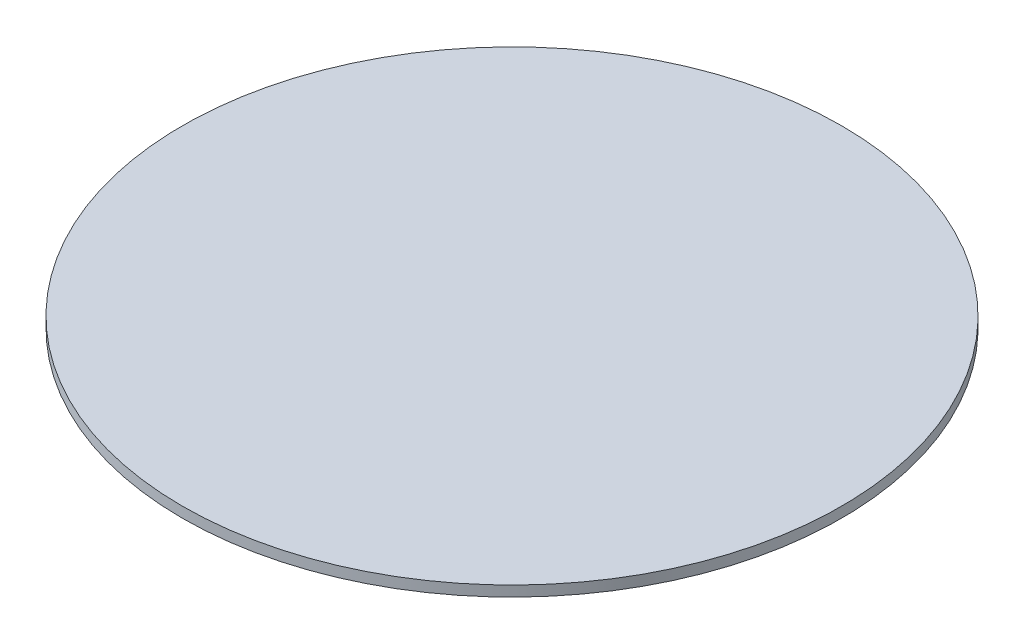
ISO-10303-21;
HEADER;
FILE_DESCRIPTION(('STEP AP214'),'2;1');
FILE_NAME('part.step','',(''),(''),'','','');
FILE_SCHEMA(('AUTOMOTIVE_DESIGN { 1 0 10303 214 1 1 1 1 }'));
ENDSEC;
DATA;
#1=APPLICATION_CONTEXT('core data for automotive mechanical design processes');
#2=APPLICATION_PROTOCOL_DEFINITION('international standard','automotive_design',2000,#1);
#3=PRODUCT_CONTEXT('',#1,'mechanical');
#4=PRODUCT('Part','Part','',(#3));
#5=PRODUCT_RELATED_PRODUCT_CATEGORY('part','',(#4));
#6=PRODUCT_DEFINITION_FORMATION('','',#4);
#7=PRODUCT_DEFINITION_CONTEXT('part definition',#1,'design');
#8=PRODUCT_DEFINITION('design','',#6,#7);
#9=PRODUCT_DEFINITION_SHAPE('','',#8);
#10=(LENGTH_UNIT() NAMED_UNIT(*) SI_UNIT(.MILLI.,.METRE.));
#11=(NAMED_UNIT(*) PLANE_ANGLE_UNIT() SI_UNIT($,.RADIAN.));
#12=(NAMED_UNIT(*) SI_UNIT($,.STERADIAN.) SOLID_ANGLE_UNIT());
#13=UNCERTAINTY_MEASURE_WITH_UNIT(LENGTH_MEASURE(1.E-05),#10,'distance_accuracy_value','');
#14=(GEOMETRIC_REPRESENTATION_CONTEXT(3) GLOBAL_UNCERTAINTY_ASSIGNED_CONTEXT((#13)) GLOBAL_UNIT_ASSIGNED_CONTEXT((#10,
#11,#12)) REPRESENTATION_CONTEXT('',''));
#15=CARTESIAN_POINT('',(0.,0.,0.));
#16=DIRECTION('',(0.,0.,1.));
#17=DIRECTION('',(1.,0.,0.));
#18=AXIS2_PLACEMENT_3D('',#15,#16,#17);
#19=CARTESIAN_POINT('',(0.,38.1,0.));
#20=DIRECTION('',(0.,-1.,0.));
#21=DIRECTION('',(0.,0.,-1.));
#22=AXIS2_PLACEMENT_3D('',#19,#20,#21);
#23=CYLINDRICAL_SURFACE('',#22,1200.);
#24=CARTESIAN_POINT('',(0.,38.1,0.));
#25=DIRECTION('',(0.,1.,0.));
#26=DIRECTION('',(0.,0.,1.));
#27=AXIS2_PLACEMENT_3D('',#24,#25,#26);
#28=CIRCLE('',#27,1200.);
#29=CARTESIAN_POINT('',(0.,38.1,1200.));
#30=VERTEX_POINT('',#29);
#31=EDGE_CURVE('E10',#30,#30,#28,.T.);
#32=ORIENTED_EDGE('',*,*,#31,.F.);
#33=EDGE_LOOP('',(#32));
#34=FACE_BOUND('',#33,.T.);
#35=CARTESIAN_POINT('',(0.,0.,0.));
#36=DIRECTION('',(0.,1.,0.));
#37=DIRECTION('',(0.,0.,1.));
#38=AXIS2_PLACEMENT_3D('',#35,#36,#37);
#39=CIRCLE('',#38,1200.);
#40=CARTESIAN_POINT('',(0.,0.,1200.));
#41=VERTEX_POINT('',#40);
#42=EDGE_CURVE('E38',#41,#41,#39,.T.);
#43=ORIENTED_EDGE('',*,*,#42,.T.);
#44=EDGE_LOOP('',(#43));
#45=FACE_BOUND('',#44,.T.);
#46=ADVANCED_FACE('F35',(#34,#45),#23,.T.);
#47=CARTESIAN_POINT('',(0.,38.1,0.));
#48=DIRECTION('',(0.,1.,0.));
#49=DIRECTION('',(0.,0.,1.));
#50=AXIS2_PLACEMENT_3D('',#47,#48,#49);
#51=PLANE('',#50);
#52=ORIENTED_EDGE('',*,*,#31,.T.);
#53=EDGE_LOOP('',(#52));
#54=FACE_BOUND('',#53,.T.);
#55=ADVANCED_FACE('F50',(#54),#51,.T.);
#56=CARTESIAN_POINT('',(0.,0.,0.));
#57=DIRECTION('',(0.,1.,0.));
#58=DIRECTION('',(0.,0.,1.));
#59=AXIS2_PLACEMENT_3D('',#56,#57,#58);
#60=PLANE('',#59);
#61=ORIENTED_EDGE('',*,*,#42,.F.);
#62=EDGE_LOOP('',(#61));
#63=FACE_BOUND('',#62,.T.);
#64=ADVANCED_FACE('F48',(#63),#60,.F.);
#65=CLOSED_SHELL('',(#46,#55,#64));
#66=MANIFOLD_SOLID_BREP('B2',#65);
#67=ADVANCED_BREP_SHAPE_REPRESENTATION('',(#18,#66),#14);
#68=SHAPE_DEFINITION_REPRESENTATION(#9,#67);
ENDSEC;
END-ISO-10303-21;
